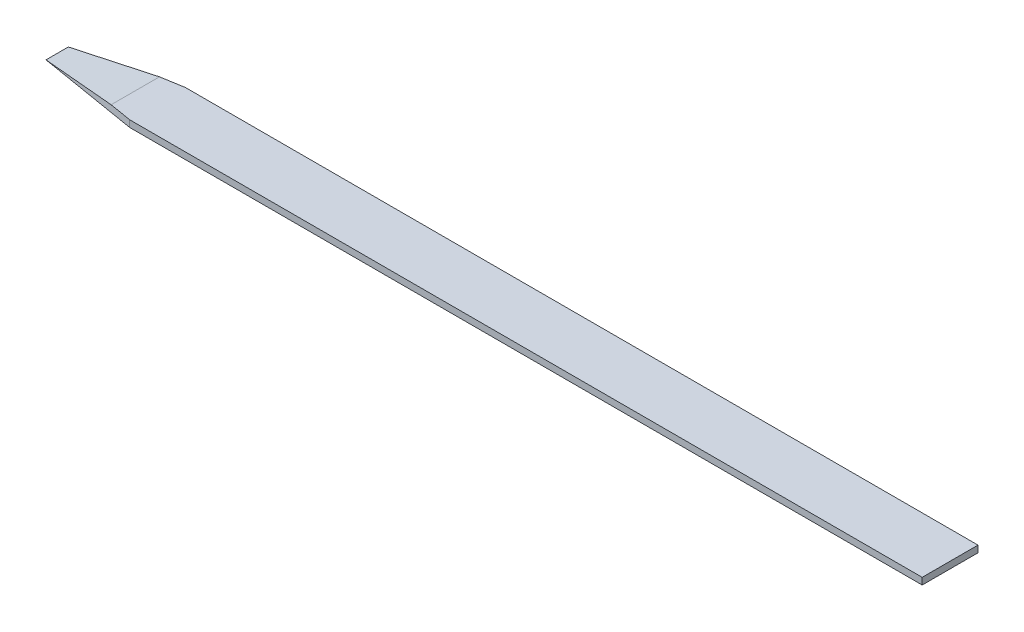
ISO-10303-21;
HEADER;
FILE_DESCRIPTION(('STEP AP214'),'2;1');
FILE_NAME('part.step','',(''),(''),'','','');
FILE_SCHEMA(('AUTOMOTIVE_DESIGN { 1 0 10303 214 1 1 1 1 }'));
ENDSEC;
DATA;
#1=APPLICATION_CONTEXT('core data for automotive mechanical design processes');
#2=APPLICATION_PROTOCOL_DEFINITION('international standard','automotive_design',2000,#1);
#3=PRODUCT_CONTEXT('',#1,'mechanical');
#4=PRODUCT('Part','Part','',(#3));
#5=PRODUCT_RELATED_PRODUCT_CATEGORY('part','',(#4));
#6=PRODUCT_DEFINITION_FORMATION('','',#4);
#7=PRODUCT_DEFINITION_CONTEXT('part definition',#1,'design');
#8=PRODUCT_DEFINITION('design','',#6,#7);
#9=PRODUCT_DEFINITION_SHAPE('','',#8);
#10=(LENGTH_UNIT() NAMED_UNIT(*) SI_UNIT(.MILLI.,.METRE.));
#11=(NAMED_UNIT(*) PLANE_ANGLE_UNIT() SI_UNIT($,.RADIAN.));
#12=(NAMED_UNIT(*) SI_UNIT($,.STERADIAN.) SOLID_ANGLE_UNIT());
#13=UNCERTAINTY_MEASURE_WITH_UNIT(LENGTH_MEASURE(1.E-05),#10,'distance_accuracy_value','');
#14=(GEOMETRIC_REPRESENTATION_CONTEXT(3) GLOBAL_UNCERTAINTY_ASSIGNED_CONTEXT((#13)) GLOBAL_UNIT_ASSIGNED_CONTEXT((#10,
#11,#12)) REPRESENTATION_CONTEXT('',''));
#15=CARTESIAN_POINT('',(0.,0.,0.));
#16=DIRECTION('',(0.,0.,1.));
#17=DIRECTION('',(1.,0.,0.));
#18=AXIS2_PLACEMENT_3D('',#15,#16,#17);
#19=CARTESIAN_POINT('',(0.,0.06,0.));
#20=DIRECTION('',(0.,1.,0.));
#21=DIRECTION('',(0.,0.,1.));
#22=AXIS2_PLACEMENT_3D('',#19,#20,#21);
#23=PLANE('',#22);
#24=DIRECTION('',(0.,0.,1.));
#25=VECTOR('',#24,1.);
#26=CARTESIAN_POINT('',(0.,0.06,0.));
#27=LINE('',#26,#25);
#28=CARTESIAN_POINT('',(0.,0.06,-0.249999999999999));
#29=VERTEX_POINT('',#28);
#30=CARTESIAN_POINT('',(0.,0.06,0.249999999999999));
#31=VERTEX_POINT('',#30);
#32=EDGE_CURVE('E111',#29,#31,#27,.T.);
#33=ORIENTED_EDGE('',*,*,#32,.F.);
#34=DIRECTION('',(1.,0.,0.));
#35=VECTOR('',#34,1.);
#36=CARTESIAN_POINT('',(0.,0.06,-0.25));
#37=LINE('',#36,#35);
#38=CARTESIAN_POINT('',(-7.1,0.06,-0.249999999999999));
#39=VERTEX_POINT('',#38);
#40=EDGE_CURVE('E100',#39,#29,#37,.T.);
#41=ORIENTED_EDGE('',*,*,#40,.F.);
#42=DIRECTION('',(0.986393923832144,0.,-0.164398987305357));
#43=VECTOR('',#42,1.);
#44=CARTESIAN_POINT('',(-8.,0.06,-0.0999999999999994));
#45=LINE('',#44,#43);
#46=CARTESIAN_POINT('',(-7.30000000000003,0.0599999999999987,-0.216666666666661));
#47=VERTEX_POINT('',#46);
#48=EDGE_CURVE('E170',#47,#39,#45,.T.);
#49=ORIENTED_EDGE('',*,*,#48,.F.);
#50=DIRECTION('',(0.,0.,1.));
#51=VECTOR('',#50,1.);
#52=CARTESIAN_POINT('',(-7.3,0.06,-1.));
#53=LINE('',#52,#51);
#54=CARTESIAN_POINT('',(-7.3,0.06,0.216666666666666));
#55=VERTEX_POINT('',#54);
#56=EDGE_CURVE('E131',#47,#55,#53,.T.);
#57=ORIENTED_EDGE('',*,*,#56,.T.);
#58=DIRECTION('',(0.986393923832144,0.,0.164398987305357));
#59=VECTOR('',#58,1.);
#60=CARTESIAN_POINT('',(-8.,0.06,0.0999999999999994));
#61=LINE('',#60,#59);
#62=CARTESIAN_POINT('',(-7.1,0.06,0.249999999999999));
#63=VERTEX_POINT('',#62);
#64=EDGE_CURVE('E62',#55,#63,#61,.T.);
#65=ORIENTED_EDGE('',*,*,#64,.T.);
#66=DIRECTION('',(1.,0.,0.));
#67=VECTOR('',#66,1.);
#68=CARTESIAN_POINT('',(0.,0.06,0.25));
#69=LINE('',#68,#67);
#70=EDGE_CURVE('E47',#63,#31,#69,.T.);
#71=ORIENTED_EDGE('',*,*,#70,.T.);
#72=EDGE_LOOP('',(#33,#41,#49,#57,#65,#71));
#73=FACE_BOUND('',#72,.T.);
#74=ADVANCED_FACE('F43',(#73),#23,.T.);
#75=CARTESIAN_POINT('',(0.,0.,0.));
#76=DIRECTION('',(0.,1.,0.));
#77=DIRECTION('',(0.,0.,1.));
#78=AXIS2_PLACEMENT_3D('',#75,#76,#77);
#79=PLANE('',#78);
#80=DIRECTION('',(1.,0.,0.));
#81=VECTOR('',#80,1.);
#82=CARTESIAN_POINT('',(0.,0.,-0.25));
#83=LINE('',#82,#81);
#84=CARTESIAN_POINT('',(-7.1,0.,-0.249999999999999));
#85=VERTEX_POINT('',#84);
#86=CARTESIAN_POINT('',(0.,0.,-0.249999999999999));
#87=VERTEX_POINT('',#86);
#88=EDGE_CURVE('E137',#85,#87,#83,.T.);
#89=ORIENTED_EDGE('',*,*,#88,.T.);
#90=DIRECTION('',(0.,0.,1.));
#91=VECTOR('',#90,1.);
#92=CARTESIAN_POINT('',(0.,0.,0.));
#93=LINE('',#92,#91);
#94=CARTESIAN_POINT('',(0.,0.,0.249999999999999));
#95=VERTEX_POINT('',#94);
#96=EDGE_CURVE('E116',#87,#95,#93,.T.);
#97=ORIENTED_EDGE('',*,*,#96,.T.);
#98=DIRECTION('',(1.,0.,0.));
#99=VECTOR('',#98,1.);
#100=CARTESIAN_POINT('',(0.,0.,0.25));
#101=LINE('',#100,#99);
#102=CARTESIAN_POINT('',(-7.1,0.,0.249999999999999));
#103=VERTEX_POINT('',#102);
#104=EDGE_CURVE('E124',#103,#95,#101,.T.);
#105=ORIENTED_EDGE('',*,*,#104,.F.);
#106=DIRECTION('',(0.986393923832144,0.,0.164398987305357));
#107=VECTOR('',#106,1.);
#108=CARTESIAN_POINT('',(-8.,0.,0.0999999999999994));
#109=LINE('',#108,#107);
#110=CARTESIAN_POINT('',(-8.,0.,0.0999999999999994));
#111=VERTEX_POINT('',#110);
#112=EDGE_CURVE('E157',#111,#103,#109,.T.);
#113=ORIENTED_EDGE('',*,*,#112,.F.);
#114=DIRECTION('',(0.,0.,-1.));
#115=VECTOR('',#114,1.);
#116=CARTESIAN_POINT('',(-8.,0.,0.));
#117=LINE('',#116,#115);
#118=CARTESIAN_POINT('',(-8.,0.,-0.0999999999999992));
#119=VERTEX_POINT('',#118);
#120=EDGE_CURVE('E127',#111,#119,#117,.T.);
#121=ORIENTED_EDGE('',*,*,#120,.T.);
#122=DIRECTION('',(0.986393923832144,0.,-0.164398987305357));
#123=VECTOR('',#122,1.);
#124=CARTESIAN_POINT('',(-8.,0.,-0.0999999999999994));
#125=LINE('',#124,#123);
#126=EDGE_CURVE('E70',#119,#85,#125,.T.);
#127=ORIENTED_EDGE('',*,*,#126,.T.);
#128=EDGE_LOOP('',(#89,#97,#105,#113,#121,#127));
#129=FACE_BOUND('',#128,.T.);
#130=ADVANCED_FACE('F165',(#129),#79,.F.);
#131=CARTESIAN_POINT('',(0.,0.06,0.));
#132=DIRECTION('',(1.,0.,0.));
#133=DIRECTION('',(0.,0.,-1.));
#134=AXIS2_PLACEMENT_3D('',#131,#132,#133);
#135=PLANE('',#134);
#136=ORIENTED_EDGE('',*,*,#96,.F.);
#137=DIRECTION('',(0.,1.,0.));
#138=VECTOR('',#137,1.);
#139=CARTESIAN_POINT('',(0.,-2.44,-0.249999999999999));
#140=LINE('',#139,#138);
#141=EDGE_CURVE('E104',#87,#29,#140,.T.);
#142=ORIENTED_EDGE('',*,*,#141,.T.);
#143=ORIENTED_EDGE('',*,*,#32,.T.);
#144=DIRECTION('',(0.,1.,0.));
#145=VECTOR('',#144,1.);
#146=CARTESIAN_POINT('',(0.,-2.44,0.249999999999999));
#147=LINE('',#146,#145);
#148=EDGE_CURVE('E119',#95,#31,#147,.T.);
#149=ORIENTED_EDGE('',*,*,#148,.F.);
#150=EDGE_LOOP('',(#136,#142,#143,#149));
#151=FACE_BOUND('',#150,.T.);
#152=ADVANCED_FACE('F45',(#151),#135,.T.);
#153=CARTESIAN_POINT('',(0.,0.06,-0.25));
#154=DIRECTION('',(0.,0.,-1.));
#155=DIRECTION('',(-1.,0.,0.));
#156=AXIS2_PLACEMENT_3D('',#153,#154,#155);
#157=PLANE('',#156);
#158=ORIENTED_EDGE('',*,*,#88,.F.);
#159=DIRECTION('',(0.,-1.,0.));
#160=VECTOR('',#159,1.);
#161=CARTESIAN_POINT('',(-7.1,0.06,-0.249999999999999));
#162=LINE('',#161,#160);
#163=EDGE_CURVE('E106',#39,#85,#162,.T.);
#164=ORIENTED_EDGE('',*,*,#163,.F.);
#165=ORIENTED_EDGE('',*,*,#40,.T.);
#166=ORIENTED_EDGE('',*,*,#141,.F.);
#167=EDGE_LOOP('',(#158,#164,#165,#166));
#168=FACE_BOUND('',#167,.T.);
#169=ADVANCED_FACE('F103',(#168),#157,.T.);
#170=CARTESIAN_POINT('',(-7.3,0.06,-1.));
#171=DIRECTION('',(-0.0854011413464359,0.996346649041751,0.));
#172=DIRECTION('',(-0.996346649041751,-0.0854011413464359,0.));
#173=AXIS2_PLACEMENT_3D('',#170,#171,#172);
#174=PLANE('',#173);
#175=ORIENTED_EDGE('',*,*,#56,.F.);
#176=DIRECTION('',(-0.982887157648091,-0.0842474706555508,0.163814526274682));
#177=VECTOR('',#176,1.);
#178=CARTESIAN_POINT('',(-7.17387456461259,0.0708107516046354,-0.237687572564568));
#179=LINE('',#178,#177);
#180=EDGE_CURVE('E12',#47,#119,#179,.T.);
#181=ORIENTED_EDGE('',*,*,#180,.T.);
#182=ORIENTED_EDGE('',*,*,#120,.F.);
#183=DIRECTION('',(-0.982887157648091,-0.0842474706555508,-0.163814526274682));
#184=VECTOR('',#183,1.);
#185=CARTESIAN_POINT('',(-7.49589695283577,0.043208832614077,0.184017174527371));
#186=LINE('',#185,#184);
#187=EDGE_CURVE('E54',#55,#111,#186,.T.);
#188=ORIENTED_EDGE('',*,*,#187,.F.);
#189=EDGE_LOOP('',(#175,#181,#182,#188));
#190=FACE_BOUND('',#189,.T.);
#191=ADVANCED_FACE('F168',(#190),#174,.T.);
#192=CARTESIAN_POINT('',(0.,0.06,0.25));
#193=DIRECTION('',(0.,0.,-1.));
#194=DIRECTION('',(-1.,0.,0.));
#195=AXIS2_PLACEMENT_3D('',#192,#193,#194);
#196=PLANE('',#195);
#197=ORIENTED_EDGE('',*,*,#70,.F.);
#198=DIRECTION('',(0.,-1.,0.));
#199=VECTOR('',#198,1.);
#200=CARTESIAN_POINT('',(-7.1,0.06,0.249999999999999));
#201=LINE('',#200,#199);
#202=EDGE_CURVE('E118',#63,#103,#201,.T.);
#203=ORIENTED_EDGE('',*,*,#202,.T.);
#204=ORIENTED_EDGE('',*,*,#104,.T.);
#205=ORIENTED_EDGE('',*,*,#148,.T.);
#206=EDGE_LOOP('',(#197,#203,#204,#205));
#207=FACE_BOUND('',#206,.T.);
#208=ADVANCED_FACE('F194',(#207),#196,.F.);
#209=CARTESIAN_POINT('',(-8.,0.06,0.0999999999999994));
#210=DIRECTION('',(0.164398987305357,0.,-0.986393923832144));
#211=DIRECTION('',(-0.986393923832144,0.,-0.164398987305357));
#212=AXIS2_PLACEMENT_3D('',#209,#210,#211);
#213=PLANE('',#212);
#214=ORIENTED_EDGE('',*,*,#187,.T.);
#215=ORIENTED_EDGE('',*,*,#112,.T.);
#216=ORIENTED_EDGE('',*,*,#202,.F.);
#217=ORIENTED_EDGE('',*,*,#64,.F.);
#218=EDGE_LOOP('',(#214,#215,#216,#217));
#219=FACE_BOUND('',#218,.T.);
#220=ADVANCED_FACE('F156',(#219),#213,.F.);
#221=CARTESIAN_POINT('',(-8.,0.06,-0.0999999999999994));
#222=DIRECTION('',(-0.164398987305357,0.,-0.986393923832144));
#223=DIRECTION('',(-0.986393923832144,0.,0.164398987305357));
#224=AXIS2_PLACEMENT_3D('',#221,#222,#223);
#225=PLANE('',#224);
#226=ORIENTED_EDGE('',*,*,#48,.T.);
#227=ORIENTED_EDGE('',*,*,#163,.T.);
#228=ORIENTED_EDGE('',*,*,#126,.F.);
#229=ORIENTED_EDGE('',*,*,#180,.F.);
#230=EDGE_LOOP('',(#226,#227,#228,#229));
#231=FACE_BOUND('',#230,.T.);
#232=ADVANCED_FACE('F169',(#231),#225,.T.);
#233=CLOSED_SHELL('',(#74,#130,#152,#169,#191,#208,#220,#232));
#234=MANIFOLD_SOLID_BREP('B2',#233);
#235=ADVANCED_BREP_SHAPE_REPRESENTATION('',(#18,#234),#14);
#236=SHAPE_DEFINITION_REPRESENTATION(#9,#235);
ENDSEC;
END-ISO-10303-21;
